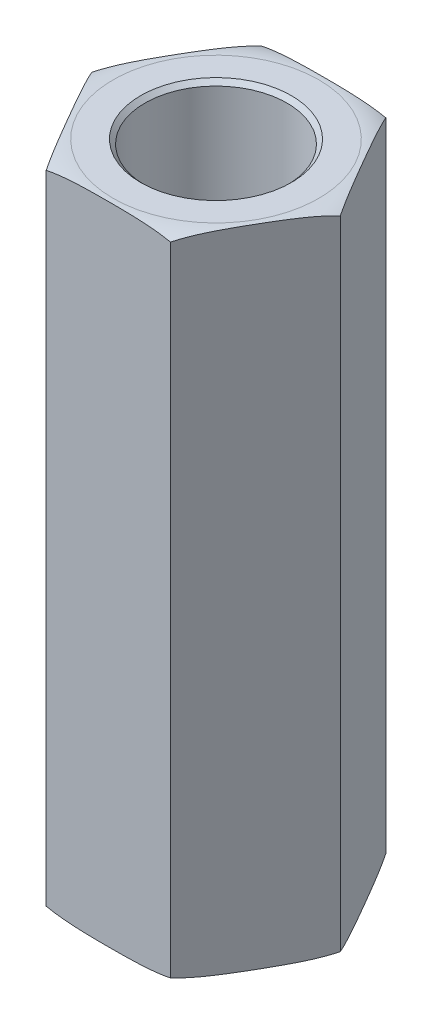
ISO-10303-21;
HEADER;
FILE_DESCRIPTION(('STEP AP214'),'2;1');
FILE_NAME('part.step','',(''),(''),'','','');
FILE_SCHEMA(('AUTOMOTIVE_DESIGN { 1 0 10303 214 1 1 1 1 }'));
ENDSEC;
DATA;
#1=APPLICATION_CONTEXT('core data for automotive mechanical design processes');
#2=APPLICATION_PROTOCOL_DEFINITION('international standard','automotive_design',2000,#1);
#3=PRODUCT_CONTEXT('',#1,'mechanical');
#4=PRODUCT('Part','Part','',(#3));
#5=PRODUCT_RELATED_PRODUCT_CATEGORY('part','',(#4));
#6=PRODUCT_DEFINITION_FORMATION('','',#4);
#7=PRODUCT_DEFINITION_CONTEXT('part definition',#1,'design');
#8=PRODUCT_DEFINITION('design','',#6,#7);
#9=PRODUCT_DEFINITION_SHAPE('','',#8);
#10=(LENGTH_UNIT() NAMED_UNIT(*) SI_UNIT(.MILLI.,.METRE.));
#11=(NAMED_UNIT(*) PLANE_ANGLE_UNIT() SI_UNIT($,.RADIAN.));
#12=(NAMED_UNIT(*) SI_UNIT($,.STERADIAN.) SOLID_ANGLE_UNIT());
#13=UNCERTAINTY_MEASURE_WITH_UNIT(LENGTH_MEASURE(1.E-05),#10,'distance_accuracy_value','');
#14=(GEOMETRIC_REPRESENTATION_CONTEXT(3) GLOBAL_UNCERTAINTY_ASSIGNED_CONTEXT((#13)) GLOBAL_UNIT_ASSIGNED_CONTEXT((#10,
#11,#12)) REPRESENTATION_CONTEXT('',''));
#15=CARTESIAN_POINT('',(0.,0.,0.));
#16=DIRECTION('',(0.,0.,1.));
#17=DIRECTION('',(1.,0.,0.));
#18=AXIS2_PLACEMENT_3D('',#15,#16,#17);
#19=CARTESIAN_POINT('',(3.66617420935412,9.525,0.));
#20=DIRECTION('',(-0.866025403784439,0.,0.5));
#21=DIRECTION('',(0.5,0.,0.866025403784439));
#22=AXIS2_PLACEMENT_3D('',#19,#20,#21);
#23=PLANE('',#22);
#24=DIRECTION('',(0.,1.,0.));
#25=VECTOR('',#24,1.);
#26=CARTESIAN_POINT('',(1.83308710467705,9.525,-3.175));
#27=LINE('',#26,#25);
#28=CARTESIAN_POINT('',(1.83308710467705,-9.398,-3.175));
#29=VERTEX_POINT('',#28);
#30=CARTESIAN_POINT('',(1.83308710467706,9.398,-3.175));
#31=VERTEX_POINT('',#30);
#32=EDGE_CURVE('E142',#29,#31,#27,.T.);
#33=ORIENTED_EDGE('',*,*,#32,.T.);
#34=CARTESIAN_POINT('',(3.66617420935412,9.398,0.));
#35=CARTESIAN_POINT('',(3.62797961467395,9.41390141489969,-0.0661549785605542));
#36=CARTESIAN_POINT('',(3.58956810864157,9.4274886076105,-0.132685658603869));
#37=CARTESIAN_POINT('',(3.51249051795711,9.45081619794021,-0.266187961794349));
#38=CARTESIAN_POINT('',(3.47382473049847,9.46056047713974,-0.333159070187379));
#39=CARTESIAN_POINT('',(3.39641631867874,9.4769966530451,-0.467234372392366));
#40=CARTESIAN_POINT('',(3.35767399633313,9.48369453286691,-0.534338043098168));
#41=CARTESIAN_POINT('',(3.28009834620114,9.4947767572932,-0.668703010556962));
#42=CARTESIAN_POINT('',(3.24126499587772,9.49916045047396,-0.735964346345247));
#43=CARTESIAN_POINT('',(3.16354065964316,9.50624030042628,-0.870586845688074));
#44=CARTESIAN_POINT('',(3.12464965374477,9.50893552375912,-0.937948043861543));
#45=CARTESIAN_POINT('',(3.04685144594594,9.51315319837134,-1.07269849250692));
#46=CARTESIAN_POINT('',(3.00794424351971,9.51467560802717,-1.14008774388952));
#47=CARTESIAN_POINT('',(2.93051517598875,9.51692270588903,-1.27419882283583));
#48=CARTESIAN_POINT('',(2.89199336248936,9.51765524681809,-1.34092056101645));
#49=CARTESIAN_POINT('',(2.81494778346146,9.51857673025742,-1.47436741839135));
#50=CARTESIAN_POINT('',(2.77642401791441,9.51876566589491,-1.5410925376177));
#51=CARTESIAN_POINT('',(2.69935964431015,9.51866599668056,-1.67457194815376));
#52=CARTESIAN_POINT('',(2.66081903631824,9.51837718117656,-1.74132623935034));
#53=CARTESIAN_POINT('',(2.58373908085332,9.517221986219,-1.87483263846072));
#54=CARTESIAN_POINT('',(2.54519973341248,9.51635559703857,-1.94158474631881));
#55=CARTESIAN_POINT('',(2.46812969629774,9.51378619406564,-2.07507396634277));
#56=CARTESIAN_POINT('',(2.42959900625968,9.51208322716166,-2.14181107913937));
#57=CARTESIAN_POINT('',(2.35255651340912,9.50743872297261,-2.27525259109831));
#58=CARTESIAN_POINT('',(2.31404470975446,9.50449724713581,-2.34195699171929));
#59=CARTESIAN_POINT('',(2.25084206239948,9.49821741247489,-2.45142718811098));
#60=CARTESIAN_POINT('',(2.22613849337013,9.49539801104633,-2.4942150247981));
#61=CARTESIAN_POINT('',(2.1767694527223,9.48886967943037,-2.57972471152106));
#62=CARTESIAN_POINT('',(2.15210397034186,9.48516108091391,-2.62244658019719));
#63=CARTESIAN_POINT('',(2.10282753811698,9.4766802711497,-2.70779586442641));
#64=CARTESIAN_POINT('',(2.07821657107531,9.47190846570085,-2.75042330976598));
#65=CARTESIAN_POINT('',(2.02900094683551,9.4610987712516,-2.83566727147553));
#66=CARTESIAN_POINT('',(2.00439646085464,9.45505773130843,-2.87828349128851));
#67=CARTESIAN_POINT('',(1.95527325900934,9.44151383541612,-2.96336737271503));
#68=CARTESIAN_POINT('',(1.93075459617615,9.43401019780297,-3.00583494247578));
#69=CARTESIAN_POINT('',(1.88182157373171,9.41732035070844,-3.09058942351744));
#70=CARTESIAN_POINT('',(1.85740744053269,9.40813149780328,-3.1328759426409));
#71=CARTESIAN_POINT('',(1.83308710467706,9.398,-3.175));
#72=B_SPLINE_CURVE_WITH_KNOTS('',3,(#34,#35,#36,#37,#38,#39,#40,#41,#42,#43,#44,#45,#46,#47,#48,
#49,#50,#51,#52,#53,#54,#55,#56,#57,#58,#59,#60,#61,#62,#63,#64,#65,#66,#67,#68,#69,#70,#71),
.UNSPECIFIED.,.F.,.F.,(4,2,2,2,2,2,2,2,2,2,2,2,2,2,2,2,2,2,4),(0.,0.233977307817935,
0.467717675040681,0.70099697355748,0.934341903229723,1.16781571967236,1.40129782179821,
1.63243665809665,1.86357841666612,2.09482211846288,2.32606971471488,2.5573043514739,
2.78852751694405,2.93698369265081,3.08538458004469,3.23372892334581,3.3824459854661,
3.53124274626083,3.68027493713586),.UNSPECIFIED.);
#73=CARTESIAN_POINT('',(3.66617420935412,9.398,0.));
#74=VERTEX_POINT('',#73);
#75=EDGE_CURVE('E96',#74,#31,#72,.T.);
#76=ORIENTED_EDGE('',*,*,#75,.F.);
#77=DIRECTION('',(0.,1.,0.));
#78=VECTOR('',#77,1.);
#79=CARTESIAN_POINT('',(3.66617420935412,9.525,0.));
#80=LINE('',#79,#78);
#81=CARTESIAN_POINT('',(3.66617420935412,-9.398,0.));
#82=VERTEX_POINT('',#81);
#83=EDGE_CURVE('E144',#74,#82,#80,.F.);
#84=ORIENTED_EDGE('',*,*,#83,.T.);
#85=CARTESIAN_POINT('',(1.83308710467705,-9.398,-3.17500000000001));
#86=CARTESIAN_POINT('',(1.87128169935722,-9.41390141489968,-3.10884502143945));
#87=CARTESIAN_POINT('',(1.9096932053896,-9.4274886076105,-3.04231434139614));
#88=CARTESIAN_POINT('',(1.98677079607406,-9.4508161979402,-2.90881203820566));
#89=CARTESIAN_POINT('',(2.0254365835327,-9.46056047713973,-2.84184092981263));
#90=CARTESIAN_POINT('',(2.10284499535243,-9.47699665304509,-2.70776562760765));
#91=CARTESIAN_POINT('',(2.14158731769803,-9.48369453286691,-2.64066195690184));
#92=CARTESIAN_POINT('',(2.21916296783002,-9.49477675729319,-2.50629698944305));
#93=CARTESIAN_POINT('',(2.25799631815344,-9.49916045047396,-2.43903565365477));
#94=CARTESIAN_POINT('',(2.335720654388,-9.50624030042628,-2.30441315431194));
#95=CARTESIAN_POINT('',(2.37461166028639,-9.50893552375912,-2.23705195613848));
#96=CARTESIAN_POINT('',(2.45240986808522,-9.51315319837134,-2.10230150749311));
#97=CARTESIAN_POINT('',(2.49131707051145,-9.51467560802717,-2.0349122561105));
#98=CARTESIAN_POINT('',(2.56874613804241,-9.51692270588903,-1.9008011771642));
#99=CARTESIAN_POINT('',(2.6072679515418,-9.51765524681809,-1.83407943898357));
#100=CARTESIAN_POINT('',(2.6843135305697,-9.51857673025742,-1.70063258160867));
#101=CARTESIAN_POINT('',(2.72283729611674,-9.51876566589491,-1.63390746238233));
#102=CARTESIAN_POINT('',(2.79990166972101,-9.51866599668056,-1.50042805184627));
#103=CARTESIAN_POINT('',(2.83844227771292,-9.51837718117656,-1.43367376064969));
#104=CARTESIAN_POINT('',(2.91552223317783,-9.517221986219,-1.30016736153931));
#105=CARTESIAN_POINT('',(2.95406158061867,-9.51635559703857,-1.23341525368122));
#106=CARTESIAN_POINT('',(3.03113161773342,-9.51378619406564,-1.09992603365727));
#107=CARTESIAN_POINT('',(3.06966230777147,-9.51208322716166,-1.03318892086067));
#108=CARTESIAN_POINT('',(3.14670480062203,-9.50743872297261,-0.899747408901733));
#109=CARTESIAN_POINT('',(3.18521660427669,-9.50449724713582,-0.83304300828075));
#110=CARTESIAN_POINT('',(3.24841925163167,-9.49821741247489,-0.723572811889063));
#111=CARTESIAN_POINT('',(3.27312282066102,-9.49539801104633,-0.680784975201942));
#112=CARTESIAN_POINT('',(3.32249186130885,-9.48886967943037,-0.595275288478971));
#113=CARTESIAN_POINT('',(3.3471573436893,-9.48516108091391,-0.552553419802841));
#114=CARTESIAN_POINT('',(3.39643377591418,-9.4766802711497,-0.46720413557362));
#115=CARTESIAN_POINT('',(3.42104474295585,-9.47190846570085,-0.424576690234039));
#116=CARTESIAN_POINT('',(3.47026036719565,-9.4610987712516,-0.339332728524487));
#117=CARTESIAN_POINT('',(3.49486485317652,-9.45505773130843,-0.296716508711511));
#118=CARTESIAN_POINT('',(3.54398805502183,-9.44151383541613,-0.211632627284978));
#119=CARTESIAN_POINT('',(3.56850671785502,-9.43401019780297,-0.169165057524231));
#120=CARTESIAN_POINT('',(3.61743974029946,-9.41732035070845,-0.08441057648256));
#121=CARTESIAN_POINT('',(3.64185387349848,-9.40813149780329,-0.0421240573591054));
#122=CARTESIAN_POINT('',(3.66617420935412,-9.398,0.));
#123=B_SPLINE_CURVE_WITH_KNOTS('',3,(#85,#86,#87,#88,#89,#90,#91,#92,#93,#94,#95,#96,#97,#98,
#99,#100,#101,#102,#103,#104,#105,#106,#107,#108,#109,#110,#111,#112,#113,#114,#115,#116,#117,
#118,#119,#120,#121,#122),.UNSPECIFIED.,.F.,.F.,(4,2,2,2,2,2,2,2,2,2,2,2,2,2,2,2,2,2,4),(0.,
0.233977307817932,0.467717675040674,0.700996973557469,0.934341903229708,1.16781571967234,
1.40129782179818,1.63243665809662,1.86357841666608,2.09482211846285,2.32606971471484,
2.55730435147386,2.78852751694401,2.93698369265077,3.08538458004466,3.23372892334579,
3.38244598546609,3.53124274626083,3.68027493713586),.UNSPECIFIED.);
#124=EDGE_CURVE('E220',#29,#82,#123,.T.);
#125=ORIENTED_EDGE('',*,*,#124,.F.);
#126=EDGE_LOOP('',(#33,#76,#84,#125));
#127=FACE_BOUND('',#126,.T.);
#128=ADVANCED_FACE('F16',(#127),#23,.F.);
#129=CARTESIAN_POINT('',(1.83308710467706,9.525,3.17499999999999));
#130=DIRECTION('',(-0.866025403784439,0.,-0.5));
#131=DIRECTION('',(-0.5,0.,0.866025403784439));
#132=AXIS2_PLACEMENT_3D('',#129,#130,#131);
#133=PLANE('',#132);
#134=ORIENTED_EDGE('',*,*,#83,.F.);
#135=CARTESIAN_POINT('',(1.83308710467706,9.398,3.17499999999999));
#136=CARTESIAN_POINT('',(1.87128169935724,9.41390141489969,3.10884502143943));
#137=CARTESIAN_POINT('',(1.90969320538961,9.4274886076105,3.04231434139612));
#138=CARTESIAN_POINT('',(1.98677079607407,9.45081619794021,2.90881203820564));
#139=CARTESIAN_POINT('',(2.02543658353271,9.46056047713974,2.84184092981261));
#140=CARTESIAN_POINT('',(2.10284499535245,9.4769966530451,2.70776562760762));
#141=CARTESIAN_POINT('',(2.14158731769805,9.48369453286691,2.64066195690182));
#142=CARTESIAN_POINT('',(2.21916296783004,9.4947767572932,2.50629698944302));
#143=CARTESIAN_POINT('',(2.25799631815346,9.49916045047396,2.43903565365474));
#144=CARTESIAN_POINT('',(2.33572065438802,9.50624030042628,2.30441315431191));
#145=CARTESIAN_POINT('',(2.37461166028641,9.50893552375912,2.23705195613844));
#146=CARTESIAN_POINT('',(2.45240986808524,9.51315319837134,2.10230150749307));
#147=CARTESIAN_POINT('',(2.49131707051148,9.51467560802717,2.03491225611046));
#148=CARTESIAN_POINT('',(2.56874613804244,9.51692270588903,1.90080117716416));
#149=CARTESIAN_POINT('',(2.60726795154182,9.51765524681809,1.83407943898353));
#150=CARTESIAN_POINT('',(2.68431353056973,9.51857673025742,1.70063258160863));
#151=CARTESIAN_POINT('',(2.72283729611677,9.51876566589491,1.63390746238228));
#152=CARTESIAN_POINT('',(2.79990166972104,9.51866599668056,1.50042805184622));
#153=CARTESIAN_POINT('',(2.83844227771295,9.51837718117656,1.43367376064964));
#154=CARTESIAN_POINT('',(2.91552223317786,9.517221986219,1.30016736153926));
#155=CARTESIAN_POINT('',(2.95406158061871,9.51635559703857,1.23341525368117));
#156=CARTESIAN_POINT('',(3.03113161773345,9.51378619406564,1.09992603365721));
#157=CARTESIAN_POINT('',(3.06966230777151,9.51208322716166,1.03318892086061));
#158=CARTESIAN_POINT('',(3.14670480062207,9.50743872297261,0.899747408901672));
#159=CARTESIAN_POINT('',(3.18521660427673,9.50449724713581,0.833043008280688));
#160=CARTESIAN_POINT('',(3.24841925163171,9.49821741247489,0.723572811889004));
#161=CARTESIAN_POINT('',(3.27312282066106,9.49539801104633,0.680784975201887));
#162=CARTESIAN_POINT('',(3.32249186130888,9.48886967943037,0.595275288478923));
#163=CARTESIAN_POINT('',(3.34715734368933,9.48516108091391,0.552553419802797));
#164=CARTESIAN_POINT('',(3.3964337759142,9.4766802711497,0.467204135573584));
#165=CARTESIAN_POINT('',(3.42104474295588,9.47190846570085,0.424576690234007));
#166=CARTESIAN_POINT('',(3.47026036719567,9.4610987712516,0.339332728524462));
#167=CARTESIAN_POINT('',(3.49486485317654,9.45505773130843,0.296716508711489));
#168=CARTESIAN_POINT('',(3.54398805502184,9.44151383541612,0.211632627284964));
#169=CARTESIAN_POINT('',(3.56850671785503,9.43401019780297,0.169165057524221));
#170=CARTESIAN_POINT('',(3.61743974029946,9.41732035070844,0.0844105764825579));
#171=CARTESIAN_POINT('',(3.64185387349848,9.40813149780328,0.042124057359107));
#172=CARTESIAN_POINT('',(3.66617420935412,9.398,0.));
#173=B_SPLINE_CURVE_WITH_KNOTS('',3,(#135,#136,#137,#138,#139,#140,#141,#142,#143,#144,#145,
#146,#147,#148,#149,#150,#151,#152,#153,#154,#155,#156,#157,#158,#159,#160,#161,#162,#163,#164,
#165,#166,#167,#168,#169,#170,#171,#172),.UNSPECIFIED.,.F.,.F.,(4,2,2,2,2,2,2,2,2,2,2,2,2,2,2,2,
2,2,4),(0.,0.233977307817936,0.467717675040682,0.700996973557482,0.934341903229727,
1.16781571967237,1.40129782179821,1.63243665809666,1.86357841666612,2.09482211846289,
2.32606971471489,2.55730435147391,2.78852751694406,2.93698369265081,3.08538458004469,
3.23372892334581,3.3824459854661,3.53124274626082,3.68027493713584),.UNSPECIFIED.);
#174=CARTESIAN_POINT('',(1.83308710467707,9.398,3.17499999999999));
#175=VERTEX_POINT('',#174);
#176=EDGE_CURVE('E213',#175,#74,#173,.T.);
#177=ORIENTED_EDGE('',*,*,#176,.F.);
#178=DIRECTION('',(0.,1.,0.));
#179=VECTOR('',#178,1.);
#180=CARTESIAN_POINT('',(1.83308710467707,9.525,3.17499999999999));
#181=LINE('',#180,#179);
#182=CARTESIAN_POINT('',(1.83308710467706,-9.398,3.17499999999999));
#183=VERTEX_POINT('',#182);
#184=EDGE_CURVE('E139',#175,#183,#181,.F.);
#185=ORIENTED_EDGE('',*,*,#184,.T.);
#186=CARTESIAN_POINT('',(3.66617420935412,-9.398,0.));
#187=CARTESIAN_POINT('',(3.62797961467395,-9.41390141489969,0.0661549785605599));
#188=CARTESIAN_POINT('',(3.58956810864157,-9.4274886076105,0.132685658603875));
#189=CARTESIAN_POINT('',(3.51249051795711,-9.45081619794021,0.266187961794355));
#190=CARTESIAN_POINT('',(3.47382473049847,-9.46056047713974,0.333159070187385));
#191=CARTESIAN_POINT('',(3.39641631867874,-9.4769966530451,0.467234372392373));
#192=CARTESIAN_POINT('',(3.35767399633313,-9.48369453286691,0.534338043098174));
#193=CARTESIAN_POINT('',(3.28009834620114,-9.4947767572932,0.668703010556968));
#194=CARTESIAN_POINT('',(3.24126499587772,-9.49916045047396,0.735964346345254));
#195=CARTESIAN_POINT('',(3.16354065964316,-9.50624030042628,0.87058684568808));
#196=CARTESIAN_POINT('',(3.12464965374477,-9.50893552375912,0.93794804386155));
#197=CARTESIAN_POINT('',(3.04685144594594,-9.51315319837134,1.07269849250692));
#198=CARTESIAN_POINT('',(3.00794424351971,-9.51467560802717,1.14008774388953));
#199=CARTESIAN_POINT('',(2.93051517598875,-9.51692270588903,1.27419882283583));
#200=CARTESIAN_POINT('',(2.89199336248936,-9.51765524681809,1.34092056101646));
#201=CARTESIAN_POINT('',(2.81494778346145,-9.51857673025742,1.47436741839136));
#202=CARTESIAN_POINT('',(2.77642401791441,-9.51876566589491,1.54109253761771));
#203=CARTESIAN_POINT('',(2.69935964431015,-9.51866599668056,1.67457194815377));
#204=CARTESIAN_POINT('',(2.66081903631824,-9.51837718117656,1.74132623935035));
#205=CARTESIAN_POINT('',(2.58373908085332,-9.517221986219,1.87483263846073));
#206=CARTESIAN_POINT('',(2.54519973341248,-9.51635559703857,1.94158474631882));
#207=CARTESIAN_POINT('',(2.46812969629773,-9.51378619406564,2.07507396634278));
#208=CARTESIAN_POINT('',(2.42959900625968,-9.51208322716166,2.14181107913938));
#209=CARTESIAN_POINT('',(2.35255651340911,-9.50743872297261,2.27525259109832));
#210=CARTESIAN_POINT('',(2.31404470975446,-9.50449724713581,2.3419569917193));
#211=CARTESIAN_POINT('',(2.25084206239948,-9.49821741247489,2.45142718811099));
#212=CARTESIAN_POINT('',(2.22613849337013,-9.49539801104633,2.4942150247981));
#213=CARTESIAN_POINT('',(2.1767694527223,-9.48886967943037,2.57972471152107));
#214=CARTESIAN_POINT('',(2.15210397034186,-9.48516108091391,2.62244658019719));
#215=CARTESIAN_POINT('',(2.10282753811698,-9.4766802711497,2.70779586442641));
#216=CARTESIAN_POINT('',(2.07821657107531,-9.47190846570085,2.75042330976598));
#217=CARTESIAN_POINT('',(2.02900094683551,-9.4610987712516,2.83566727147553));
#218=CARTESIAN_POINT('',(2.00439646085465,-9.45505773130843,2.8782834912885));
#219=CARTESIAN_POINT('',(1.95527325900934,-9.44151383541612,2.96336737271503));
#220=CARTESIAN_POINT('',(1.93075459617615,-9.43401019780296,3.00583494247577));
#221=CARTESIAN_POINT('',(1.88182157373172,-9.41732035070844,3.09058942351744));
#222=CARTESIAN_POINT('',(1.8574074405327,-9.40813149780329,3.13287594264089));
#223=CARTESIAN_POINT('',(1.83308710467706,-9.398,3.17499999999999));
#224=B_SPLINE_CURVE_WITH_KNOTS('',3,(#186,#187,#188,#189,#190,#191,#192,#193,#194,#195,#196,
#197,#198,#199,#200,#201,#202,#203,#204,#205,#206,#207,#208,#209,#210,#211,#212,#213,#214,#215,
#216,#217,#218,#219,#220,#221,#222,#223),.UNSPECIFIED.,.F.,.F.,(4,2,2,2,2,2,2,2,2,2,2,2,2,2,2,2,
2,2,4),(0.,0.233977307817936,0.467717675040682,0.700996973557481,0.934341903229725,
1.16781571967236,1.40129782179821,1.63243665809665,1.86357841666612,2.09482211846289,
2.32606971471488,2.55730435147391,2.78852751694405,2.93698369265081,3.08538458004468,
3.2337289233458,3.38244598546609,3.53124274626082,3.68027493713584),.UNSPECIFIED.);
#225=EDGE_CURVE('E239',#82,#183,#224,.T.);
#226=ORIENTED_EDGE('',*,*,#225,.F.);
#227=EDGE_LOOP('',(#134,#177,#185,#226));
#228=FACE_BOUND('',#227,.T.);
#229=ADVANCED_FACE('F217',(#228),#133,.F.);
#230=CARTESIAN_POINT('',(1.83308710467706,9.525,-3.175));
#231=DIRECTION('',(0.,0.,1.));
#232=DIRECTION('',(1.,0.,0.));
#233=AXIS2_PLACEMENT_3D('',#230,#231,#232);
#234=PLANE('',#233);
#235=DIRECTION('',(0.,1.,0.));
#236=VECTOR('',#235,1.);
#237=CARTESIAN_POINT('',(-1.83308710467707,9.525,-3.175));
#238=LINE('',#237,#236);
#239=CARTESIAN_POINT('',(-1.83308710467707,-9.39799999999999,-3.175));
#240=VERTEX_POINT('',#239);
#241=CARTESIAN_POINT('',(-1.83308710467706,9.398,-3.17500000000001));
#242=VERTEX_POINT('',#241);
#243=EDGE_CURVE('E103',#240,#242,#238,.T.);
#244=ORIENTED_EDGE('',*,*,#243,.T.);
#245=CARTESIAN_POINT('',(1.83308710467706,9.398,-3.175));
#246=CARTESIAN_POINT('',(1.73237579828683,9.41894001415179,-3.175));
#247=CARTESIAN_POINT('',(1.63096506893486,9.43588534953273,-3.175));
#248=CARTESIAN_POINT('',(1.42767146651469,9.46349716439842,-3.175));
#249=CARTESIAN_POINT('',(1.32579191427254,9.47418756587531,-3.175));
#250=CARTESIAN_POINT('',(1.12177634709137,9.49112804080793,-3.175));
#251=CARTESIAN_POINT('',(1.0196405664338,9.49738127071887,-3.175));
#252=CARTESIAN_POINT('',(0.815663681397375,9.50690280641833,-3.175));
#253=CARTESIAN_POINT('',(0.713823115514573,9.5101834044999,-3.175));
#254=CARTESIAN_POINT('',(0.510018485441651,9.51494548487028,-3.175));
#255=CARTESIAN_POINT('',(0.408054390577976,9.51642541008817,-3.175));
#256=CARTESIAN_POINT('',(0.20406020033787,9.51831468183793,-3.175));
#257=CARTESIAN_POINT('',(0.102030100168935,9.51872342414921,-3.175));
#258=CARTESIAN_POINT('',(-0.102030100168934,9.51872342414921,-3.175));
#259=CARTESIAN_POINT('',(-0.204060200337869,9.51831468183793,-3.175));
#260=CARTESIAN_POINT('',(-0.408054390577975,9.51642541008817,-3.175));
#261=CARTESIAN_POINT('',(-0.510018485441649,9.51494548487028,-3.175));
#262=CARTESIAN_POINT('',(-0.713823115514571,9.5101834044999,-3.175));
#263=CARTESIAN_POINT('',(-0.815663681397373,9.50690280641833,-3.175));
#264=CARTESIAN_POINT('',(-1.01964056643379,9.49738127071887,-3.175));
#265=CARTESIAN_POINT('',(-1.12177634709137,9.49112804080793,-3.175));
#266=CARTESIAN_POINT('',(-1.32579191427253,9.47418756587531,-3.175));
#267=CARTESIAN_POINT('',(-1.42767146651469,9.46349716439842,-3.175));
#268=CARTESIAN_POINT('',(-1.63096506893485,9.43588534953273,-3.175));
#269=CARTESIAN_POINT('',(-1.73237579828683,9.41894001415179,-3.175));
#270=CARTESIAN_POINT('',(-1.83308710467705,9.398,-3.17500000000001));
#271=B_SPLINE_CURVE_WITH_KNOTS('',3,(#245,#246,#247,#248,#249,#250,#251,#252,#253,#254,#255,
#256,#257,#258,#259,#260,#261,#262,#263,#264,#265,#266,#267,#268,#269,#270),.UNSPECIFIED.,.F.,
.F.,(4,2,2,2,2,2,2,2,2,2,2,2,4),(0.,0.308333242342807,0.615479423308234,0.922406891130008,
1.2280592962085,1.53397581645216,1.84006485747889,2.14615389850561,2.45207041874927,
2.75772282382776,3.06465029164954,3.37179647261496,3.68012971495777),.UNSPECIFIED.);
#272=EDGE_CURVE('E88',#31,#242,#271,.T.);
#273=ORIENTED_EDGE('',*,*,#272,.F.);
#274=ORIENTED_EDGE('',*,*,#32,.F.);
#275=CARTESIAN_POINT('',(-1.83308710467707,-9.39799999999999,-3.175));
#276=CARTESIAN_POINT('',(-1.73237579828684,-9.41894001415179,-3.175));
#277=CARTESIAN_POINT('',(-1.63096506893487,-9.43588534953273,-3.175));
#278=CARTESIAN_POINT('',(-1.4276714665147,-9.46349716439842,-3.175));
#279=CARTESIAN_POINT('',(-1.32579191427255,-9.47418756587531,-3.175));
#280=CARTESIAN_POINT('',(-1.12177634709138,-9.49112804080793,-3.175));
#281=CARTESIAN_POINT('',(-1.0196405664338,-9.49738127071887,-3.175));
#282=CARTESIAN_POINT('',(-0.81566368139738,-9.50690280641833,-3.175));
#283=CARTESIAN_POINT('',(-0.713823115514577,-9.5101834044999,-3.175));
#284=CARTESIAN_POINT('',(-0.510018485441654,-9.51494548487028,-3.175));
#285=CARTESIAN_POINT('',(-0.408054390577979,-9.51642541008817,-3.175));
#286=CARTESIAN_POINT('',(-0.204060200337872,-9.51831468183793,-3.175));
#287=CARTESIAN_POINT('',(-0.102030100168936,-9.51872342414921,-3.175));
#288=CARTESIAN_POINT('',(0.102030100168934,-9.51872342414921,-3.175));
#289=CARTESIAN_POINT('',(0.204060200337869,-9.51831468183793,-3.175));
#290=CARTESIAN_POINT('',(0.408054390577974,-9.51642541008817,-3.175));
#291=CARTESIAN_POINT('',(0.510018485441648,-9.51494548487028,-3.175));
#292=CARTESIAN_POINT('',(0.713823115514568,-9.5101834044999,-3.175));
#293=CARTESIAN_POINT('',(0.81566368139737,-9.50690280641833,-3.175));
#294=CARTESIAN_POINT('',(1.01964056643379,-9.49738127071887,-3.175));
#295=CARTESIAN_POINT('',(1.12177634709137,-9.49112804080794,-3.175));
#296=CARTESIAN_POINT('',(1.32579191427253,-9.47418756587531,-3.175));
#297=CARTESIAN_POINT('',(1.42767146651468,-9.46349716439843,-3.175));
#298=CARTESIAN_POINT('',(1.63096506893485,-9.43588534953273,-3.175));
#299=CARTESIAN_POINT('',(1.73237579828682,-9.41894001415179,-3.175));
#300=CARTESIAN_POINT('',(1.83308710467705,-9.398,-3.175));
#301=B_SPLINE_CURVE_WITH_KNOTS('',3,(#275,#276,#277,#278,#279,#280,#281,#282,#283,#284,#285,
#286,#287,#288,#289,#290,#291,#292,#293,#294,#295,#296,#297,#298,#299,#300),.UNSPECIFIED.,.F.,
.F.,(4,2,2,2,2,2,2,2,2,2,2,2,4),(0.,0.308333242342809,0.615479423308238,0.922406891130013,
1.22805929620851,1.53397581645217,1.8400648574789,2.14615389850562,2.45207041874928,
2.75772282382777,3.06465029164954,3.37179647261497,3.68012971495777),.UNSPECIFIED.);
#302=EDGE_CURVE('E105',#240,#29,#301,.T.);
#303=ORIENTED_EDGE('',*,*,#302,.F.);
#304=EDGE_LOOP('',(#244,#273,#274,#303));
#305=FACE_BOUND('',#304,.T.);
#306=ADVANCED_FACE('F104',(#305),#234,.F.);
#307=CARTESIAN_POINT('',(-1.83308710467707,9.525,3.175));
#308=DIRECTION('',(0.,0.,-1.));
#309=DIRECTION('',(-1.,0.,0.));
#310=AXIS2_PLACEMENT_3D('',#307,#308,#309);
#311=PLANE('',#310);
#312=ORIENTED_EDGE('',*,*,#184,.F.);
#313=CARTESIAN_POINT('',(-1.83308710467706,9.398,3.175));
#314=CARTESIAN_POINT('',(-1.73237579828684,9.41894001415179,3.175));
#315=CARTESIAN_POINT('',(-1.63096506893486,9.43588534953273,3.175));
#316=CARTESIAN_POINT('',(-1.42767146651469,9.46349716439843,3.175));
#317=CARTESIAN_POINT('',(-1.32579191427254,9.47418756587531,3.175));
#318=CARTESIAN_POINT('',(-1.12177634709138,9.49112804080793,3.175));
#319=CARTESIAN_POINT('',(-1.0196405664338,9.49738127071888,3.175));
#320=CARTESIAN_POINT('',(-0.815663681397378,9.50690280641833,3.175));
#321=CARTESIAN_POINT('',(-0.713823115514575,9.5101834044999,3.175));
#322=CARTESIAN_POINT('',(-0.510018485441652,9.51494548487029,3.175));
#323=CARTESIAN_POINT('',(-0.408054390577978,9.51642541008817,3.175));
#324=CARTESIAN_POINT('',(-0.204060200337871,9.51831468183793,3.175));
#325=CARTESIAN_POINT('',(-0.102030100168935,9.51872342414921,3.17499999999999));
#326=CARTESIAN_POINT('',(0.102030100168936,9.51872342414921,3.17499999999999));
#327=CARTESIAN_POINT('',(0.204060200337871,9.51831468183793,3.17499999999999));
#328=CARTESIAN_POINT('',(0.408054390577978,9.51642541008817,3.17499999999999));
#329=CARTESIAN_POINT('',(0.510018485441653,9.51494548487029,3.17499999999999));
#330=CARTESIAN_POINT('',(0.713823115514576,9.5101834044999,3.17499999999999));
#331=CARTESIAN_POINT('',(0.815663681397379,9.50690280641833,3.17499999999999));
#332=CARTESIAN_POINT('',(1.0196405664338,9.49738127071888,3.17499999999999));
#333=CARTESIAN_POINT('',(1.12177634709138,9.49112804080794,3.17499999999999));
#334=CARTESIAN_POINT('',(1.32579191427254,9.47418756587531,3.17499999999999));
#335=CARTESIAN_POINT('',(1.4276714665147,9.46349716439843,3.17499999999999));
#336=CARTESIAN_POINT('',(1.63096506893486,9.43588534953273,3.17499999999999));
#337=CARTESIAN_POINT('',(1.73237579828684,9.41894001415179,3.17499999999999));
#338=CARTESIAN_POINT('',(1.83308710467707,9.398,3.17499999999999));
#339=B_SPLINE_CURVE_WITH_KNOTS('',3,(#313,#314,#315,#316,#317,#318,#319,#320,#321,#322,#323,
#324,#325,#326,#327,#328,#329,#330,#331,#332,#333,#334,#335,#336,#337,#338),.UNSPECIFIED.,.F.,
.F.,(4,2,2,2,2,2,2,2,2,2,2,2,4),(0.,0.308333242342809,0.615479423308237,0.922406891130012,
1.2280592962085,1.53397581645216,1.84006485747889,2.14615389850562,2.45207041874928,
2.75772282382778,3.06465029164955,3.37179647261498,3.68012971495779),.UNSPECIFIED.);
#340=CARTESIAN_POINT('',(-1.83308710467707,9.398,3.175));
#341=VERTEX_POINT('',#340);
#342=EDGE_CURVE('E99',#341,#175,#339,.T.);
#343=ORIENTED_EDGE('',*,*,#342,.F.);
#344=DIRECTION('',(0.,1.,0.));
#345=VECTOR('',#344,1.);
#346=CARTESIAN_POINT('',(-1.83308710467707,9.525,3.175));
#347=LINE('',#346,#345);
#348=CARTESIAN_POINT('',(-1.83308710467706,-9.398,3.175));
#349=VERTEX_POINT('',#348);
#350=EDGE_CURVE('E107',#341,#349,#347,.F.);
#351=ORIENTED_EDGE('',*,*,#350,.T.);
#352=CARTESIAN_POINT('',(1.83308710467706,-9.398,3.17499999999999));
#353=CARTESIAN_POINT('',(1.73237579828684,-9.41894001415179,3.17499999999999));
#354=CARTESIAN_POINT('',(1.63096506893486,-9.43588534953273,3.17499999999999));
#355=CARTESIAN_POINT('',(1.4276714665147,-9.46349716439843,3.17499999999999));
#356=CARTESIAN_POINT('',(1.32579191427254,-9.47418756587531,3.17499999999999));
#357=CARTESIAN_POINT('',(1.12177634709138,-9.49112804080793,3.17499999999999));
#358=CARTESIAN_POINT('',(1.0196405664338,-9.49738127071888,3.17499999999999));
#359=CARTESIAN_POINT('',(0.815663681397379,-9.50690280641833,3.17499999999999));
#360=CARTESIAN_POINT('',(0.713823115514576,-9.5101834044999,3.17499999999999));
#361=CARTESIAN_POINT('',(0.510018485441653,-9.51494548487029,3.17499999999999));
#362=CARTESIAN_POINT('',(0.408054390577978,-9.51642541008817,3.17499999999999));
#363=CARTESIAN_POINT('',(0.204060200337871,-9.51831468183793,3.17499999999999));
#364=CARTESIAN_POINT('',(0.102030100168935,-9.51872342414921,3.17499999999999));
#365=CARTESIAN_POINT('',(-0.102030100168935,-9.51872342414921,3.17499999999999));
#366=CARTESIAN_POINT('',(-0.204060200337871,-9.51831468183793,3.175));
#367=CARTESIAN_POINT('',(-0.408054390577977,-9.51642541008817,3.175));
#368=CARTESIAN_POINT('',(-0.510018485441652,-9.51494548487029,3.175));
#369=CARTESIAN_POINT('',(-0.713823115514575,-9.5101834044999,3.175));
#370=CARTESIAN_POINT('',(-0.815663681397378,-9.50690280641833,3.175));
#371=CARTESIAN_POINT('',(-1.0196405664338,-9.49738127071888,3.175));
#372=CARTESIAN_POINT('',(-1.12177634709138,-9.49112804080793,3.175));
#373=CARTESIAN_POINT('',(-1.32579191427254,-9.47418756587531,3.175));
#374=CARTESIAN_POINT('',(-1.42767146651469,-9.46349716439843,3.175));
#375=CARTESIAN_POINT('',(-1.63096506893486,-9.43588534953273,3.175));
#376=CARTESIAN_POINT('',(-1.73237579828684,-9.41894001415179,3.175));
#377=CARTESIAN_POINT('',(-1.83308710467706,-9.398,3.175));
#378=B_SPLINE_CURVE_WITH_KNOTS('',3,(#352,#353,#354,#355,#356,#357,#358,#359,#360,#361,#362,
#363,#364,#365,#366,#367,#368,#369,#370,#371,#372,#373,#374,#375,#376,#377),.UNSPECIFIED.,.F.,
.F.,(4,2,2,2,2,2,2,2,2,2,2,2,4),(0.,0.308333242342809,0.615479423308237,0.922406891130013,
1.22805929620851,1.53397581645217,1.84006485747889,2.14615389850562,2.45207041874928,
2.75772282382778,3.06465029164955,3.37179647261498,3.68012971495779),.UNSPECIFIED.);
#379=EDGE_CURVE('E207',#183,#349,#378,.T.);
#380=ORIENTED_EDGE('',*,*,#379,.F.);
#381=EDGE_LOOP('',(#312,#343,#351,#380));
#382=FACE_BOUND('',#381,.T.);
#383=ADVANCED_FACE('F351',(#382),#311,.F.);
#384=CARTESIAN_POINT('',(-3.66617420935413,9.525,0.));
#385=DIRECTION('',(0.866025403784439,0.,-0.499999999999999));
#386=DIRECTION('',(-0.499999999999999,0.,-0.866025403784439));
#387=AXIS2_PLACEMENT_3D('',#384,#385,#386);
#388=PLANE('',#387);
#389=ORIENTED_EDGE('',*,*,#350,.F.);
#390=CARTESIAN_POINT('',(-3.66617420935412,9.398,0.));
#391=CARTESIAN_POINT('',(-3.62797961467395,9.41390141489969,0.0661549785605627));
#392=CARTESIAN_POINT('',(-3.58956810864157,9.4274886076105,0.132685658603878));
#393=CARTESIAN_POINT('',(-3.51249051795711,9.4508161979402,0.266187961794359));
#394=CARTESIAN_POINT('',(-3.47382473049847,9.46056047713974,0.333159070187389));
#395=CARTESIAN_POINT('',(-3.39641631867874,9.47699665304509,0.467234372392377));
#396=CARTESIAN_POINT('',(-3.35767399633313,9.48369453286691,0.534338043098178));
#397=CARTESIAN_POINT('',(-3.28009834620114,9.49477675729319,0.668703010556972));
#398=CARTESIAN_POINT('',(-3.24126499587772,9.49916045047396,0.735964346345258));
#399=CARTESIAN_POINT('',(-3.16354065964316,9.50624030042628,0.870586845688085));
#400=CARTESIAN_POINT('',(-3.12464965374477,9.50893552375912,0.937948043861555));
#401=CARTESIAN_POINT('',(-3.04685144594594,9.51315319837134,1.07269849250693));
#402=CARTESIAN_POINT('',(-3.00794424351971,9.51467560802717,1.14008774388953));
#403=CARTESIAN_POINT('',(-2.93051517598875,9.51692270588903,1.27419882283584));
#404=CARTESIAN_POINT('',(-2.89199336248936,9.51765524681809,1.34092056101647));
#405=CARTESIAN_POINT('',(-2.81494778346146,9.51857673025742,1.47436741839137));
#406=CARTESIAN_POINT('',(-2.77642401791441,9.5187656658949,1.54109253761772));
#407=CARTESIAN_POINT('',(-2.69935964431015,9.51866599668056,1.67457194815378));
#408=CARTESIAN_POINT('',(-2.66081903631824,9.51837718117656,1.74132623935036));
#409=CARTESIAN_POINT('',(-2.58373908085332,9.517221986219,1.87483263846074));
#410=CARTESIAN_POINT('',(-2.54519973341248,9.51635559703857,1.94158474631883));
#411=CARTESIAN_POINT('',(-2.46812969629774,9.51378619406564,2.07507396634279));
#412=CARTESIAN_POINT('',(-2.42959900625968,9.51208322716166,2.14181107913938));
#413=CARTESIAN_POINT('',(-2.35255651340912,9.50743872297261,2.27525259109832));
#414=CARTESIAN_POINT('',(-2.31404470975446,9.50449724713581,2.34195699171931));
#415=CARTESIAN_POINT('',(-2.25084206239948,9.49821741247489,2.45142718811099));
#416=CARTESIAN_POINT('',(-2.22613849337013,9.49539801104632,2.49421502479811));
#417=CARTESIAN_POINT('',(-2.17676945272231,9.48886967943037,2.57972471152108));
#418=CARTESIAN_POINT('',(-2.15210397034186,9.48516108091391,2.6224465801972));
#419=CARTESIAN_POINT('',(-2.10282753811698,9.47668027114969,2.70779586442642));
#420=CARTESIAN_POINT('',(-2.07821657107531,9.47190846570085,2.75042330976599));
#421=CARTESIAN_POINT('',(-2.02900094683551,9.4610987712516,2.83566727147554));
#422=CARTESIAN_POINT('',(-2.00439646085465,9.45505773130842,2.87828349128851));
#423=CARTESIAN_POINT('',(-1.95527325900935,9.44151383541612,2.96336737271504));
#424=CARTESIAN_POINT('',(-1.93075459617615,9.43401019780296,3.00583494247578));
#425=CARTESIAN_POINT('',(-1.88182157373172,9.41732035070844,3.09058942351745));
#426=CARTESIAN_POINT('',(-1.8574074405327,9.40813149780328,3.1328759426409));
#427=CARTESIAN_POINT('',(-1.83308710467707,9.398,3.175));
#428=B_SPLINE_CURVE_WITH_KNOTS('',3,(#390,#391,#392,#393,#394,#395,#396,#397,#398,#399,#400,
#401,#402,#403,#404,#405,#406,#407,#408,#409,#410,#411,#412,#413,#414,#415,#416,#417,#418,#419,
#420,#421,#422,#423,#424,#425,#426,#427),.UNSPECIFIED.,.F.,.F.,(4,2,2,2,2,2,2,2,2,2,2,2,2,2,2,2,
2,2,4),(0.,0.233977307817936,0.467717675040682,0.700996973557482,0.934341903229725,
1.16781571967237,1.40129782179821,1.63243665809665,1.86357841666612,2.09482211846289,
2.32606971471489,2.55730435147391,2.78852751694406,2.93698369265081,3.08538458004469,
3.23372892334581,3.3824459854661,3.53124274626082,3.68027493713584),.UNSPECIFIED.);
#429=CARTESIAN_POINT('',(-3.66617420935413,9.398,0.));
#430=VERTEX_POINT('',#429);
#431=EDGE_CURVE('E100',#430,#341,#428,.T.);
#432=ORIENTED_EDGE('',*,*,#431,.F.);
#433=DIRECTION('',(0.,1.,0.));
#434=VECTOR('',#433,1.);
#435=CARTESIAN_POINT('',(-3.66617420935413,9.525,0.));
#436=LINE('',#435,#434);
#437=CARTESIAN_POINT('',(-3.66617420935412,-9.398,0.));
#438=VERTEX_POINT('',#437);
#439=EDGE_CURVE('E82',#430,#438,#436,.F.);
#440=ORIENTED_EDGE('',*,*,#439,.T.);
#441=CARTESIAN_POINT('',(-1.83308710467707,-9.398,3.175));
#442=CARTESIAN_POINT('',(-1.87128169935724,-9.41390141489968,3.10884502143945));
#443=CARTESIAN_POINT('',(-1.90969320538961,-9.4274886076105,3.04231434139613));
#444=CARTESIAN_POINT('',(-1.98677079607407,-9.4508161979402,2.90881203820565));
#445=CARTESIAN_POINT('',(-2.02543658353271,-9.46056047713973,2.84184092981263));
#446=CARTESIAN_POINT('',(-2.10284499535244,-9.47699665304509,2.70776562760764));
#447=CARTESIAN_POINT('',(-2.14158731769805,-9.48369453286691,2.64066195690184));
#448=CARTESIAN_POINT('',(-2.21916296783004,-9.49477675729319,2.50629698944305));
#449=CARTESIAN_POINT('',(-2.25799631815346,-9.49916045047396,2.43903565365476));
#450=CARTESIAN_POINT('',(-2.33572065438802,-9.50624030042628,2.30441315431194));
#451=CARTESIAN_POINT('',(-2.3746116602864,-9.50893552375912,2.23705195613847));
#452=CARTESIAN_POINT('',(-2.45240986808523,-9.51315319837134,2.1023015074931));
#453=CARTESIAN_POINT('',(-2.49131707051146,-9.51467560802717,2.0349122561105));
#454=CARTESIAN_POINT('',(-2.56874613804242,-9.51692270588903,1.90080117716419));
#455=CARTESIAN_POINT('',(-2.60726795154181,-9.51765524681809,1.83407943898357));
#456=CARTESIAN_POINT('',(-2.68431353056971,-9.51857673025742,1.70063258160867));
#457=CARTESIAN_POINT('',(-2.72283729611675,-9.51876566589491,1.63390746238232));
#458=CARTESIAN_POINT('',(-2.79990166972102,-9.51866599668056,1.50042805184626));
#459=CARTESIAN_POINT('',(-2.83844227771293,-9.51837718117656,1.43367376064968));
#460=CARTESIAN_POINT('',(-2.91552223317784,-9.517221986219,1.30016736153931));
#461=CARTESIAN_POINT('',(-2.95406158061869,-9.51635559703857,1.23341525368122));
#462=CARTESIAN_POINT('',(-3.03113161773343,-9.51378619406564,1.09992603365726));
#463=CARTESIAN_POINT('',(-3.06966230777148,-9.51208322716166,1.03318892086066));
#464=CARTESIAN_POINT('',(-3.14670480062204,-9.50743872297261,0.899747408901727));
#465=CARTESIAN_POINT('',(-3.1852166042767,-9.50449724713581,0.833043008280744));
#466=CARTESIAN_POINT('',(-3.24841925163168,-9.49821741247489,0.723572811889058));
#467=CARTESIAN_POINT('',(-3.27312282066103,-9.49539801104633,0.680784975201938));
#468=CARTESIAN_POINT('',(-3.32249186130886,-9.48886967943037,0.595275288478968));
#469=CARTESIAN_POINT('',(-3.34715734368931,-9.48516108091391,0.552553419802839));
#470=CARTESIAN_POINT('',(-3.39643377591419,-9.4766802711497,0.46720413557362));
#471=CARTESIAN_POINT('',(-3.42104474295586,-9.47190846570085,0.42457669023404));
#472=CARTESIAN_POINT('',(-3.47026036719566,-9.4610987712516,0.339332728524489));
#473=CARTESIAN_POINT('',(-3.49486485317653,-9.45505773130843,0.296716508711513));
#474=CARTESIAN_POINT('',(-3.54398805502183,-9.44151383541613,0.211632627284982));
#475=CARTESIAN_POINT('',(-3.56850671785503,-9.43401019780297,0.169165057524236));
#476=CARTESIAN_POINT('',(-3.61743974029946,-9.41732035070845,0.0844105764825669));
#477=CARTESIAN_POINT('',(-3.64185387349848,-9.40813149780329,0.042124057359113));
#478=CARTESIAN_POINT('',(-3.66617420935412,-9.398,0.));
#479=B_SPLINE_CURVE_WITH_KNOTS('',3,(#441,#442,#443,#444,#445,#446,#447,#448,#449,#450,#451,
#452,#453,#454,#455,#456,#457,#458,#459,#460,#461,#462,#463,#464,#465,#466,#467,#468,#469,#470,
#471,#472,#473,#474,#475,#476,#477,#478),.UNSPECIFIED.,.F.,.F.,(4,2,2,2,2,2,2,2,2,2,2,2,2,2,2,2,
2,2,4),(0.,0.233977307817931,0.467717675040673,0.700996973557468,0.934341903229707,
1.16781571967234,1.40129782179818,1.63243665809662,1.86357841666608,2.09482211846285,
2.32606971471484,2.55730435147386,2.788527516944,2.93698369265077,3.08538458004465,
3.23372892334578,3.38244598546608,3.53124274626081,3.68027493713584),.UNSPECIFIED.);
#480=EDGE_CURVE('E161',#349,#438,#479,.T.);
#481=ORIENTED_EDGE('',*,*,#480,.F.);
#482=EDGE_LOOP('',(#389,#432,#440,#481));
#483=FACE_BOUND('',#482,.T.);
#484=ADVANCED_FACE('F210',(#483),#388,.F.);
#485=CARTESIAN_POINT('',(-1.83308710467707,9.525,-3.175));
#486=DIRECTION('',(0.866025403784439,0.,0.5));
#487=DIRECTION('',(0.5,0.,-0.866025403784439));
#488=AXIS2_PLACEMENT_3D('',#485,#486,#487);
#489=PLANE('',#488);
#490=ORIENTED_EDGE('',*,*,#439,.F.);
#491=CARTESIAN_POINT('',(-1.83308710467706,9.39799999999999,-3.17500000000001));
#492=CARTESIAN_POINT('',(-1.87128169935723,9.41390141489968,-3.10884502143945));
#493=CARTESIAN_POINT('',(-1.90969320538961,9.42748860761049,-3.04231434139614));
#494=CARTESIAN_POINT('',(-1.98677079607407,9.4508161979402,-2.90881203820567));
#495=CARTESIAN_POINT('',(-2.02543658353271,9.46056047713973,-2.84184092981264));
#496=CARTESIAN_POINT('',(-2.10284499535244,9.47699665304509,-2.70776562760765));
#497=CARTESIAN_POINT('',(-2.14158731769804,9.48369453286691,-2.64066195690185));
#498=CARTESIAN_POINT('',(-2.21916296783003,9.49477675729319,-2.50629698944306));
#499=CARTESIAN_POINT('',(-2.25799631815345,9.49916045047396,-2.43903565365478));
#500=CARTESIAN_POINT('',(-2.33572065438801,9.50624030042628,-2.30441315431196));
#501=CARTESIAN_POINT('',(-2.3746116602864,9.50893552375912,-2.23705195613849));
#502=CARTESIAN_POINT('',(-2.45240986808522,9.51315319837134,-2.10230150749312));
#503=CARTESIAN_POINT('',(-2.49131707051146,9.51467560802717,-2.03491225611052));
#504=CARTESIAN_POINT('',(-2.56874613804241,9.51692270588903,-1.90080117716422));
#505=CARTESIAN_POINT('',(-2.6072679515418,9.51765524681809,-1.83407943898359));
#506=CARTESIAN_POINT('',(-2.6843135305697,9.51857673025742,-1.70063258160869));
#507=CARTESIAN_POINT('',(-2.72283729611674,9.5187656658949,-1.63390746238234));
#508=CARTESIAN_POINT('',(-2.79990166972101,9.51866599668056,-1.50042805184629));
#509=CARTESIAN_POINT('',(-2.83844227771292,9.51837718117656,-1.43367376064971));
#510=CARTESIAN_POINT('',(-2.91552223317783,9.517221986219,-1.30016736153933));
#511=CARTESIAN_POINT('',(-2.95406158061867,9.51635559703857,-1.23341525368124));
#512=CARTESIAN_POINT('',(-3.03113161773341,9.51378619406564,-1.09992603365729));
#513=CARTESIAN_POINT('',(-3.06966230777147,9.51208322716166,-1.03318892086069));
#514=CARTESIAN_POINT('',(-3.14670480062203,9.50743872297261,-0.899747408901758));
#515=CARTESIAN_POINT('',(-3.18521660427669,9.50449724713581,-0.833043008280777));
#516=CARTESIAN_POINT('',(-3.24841925163167,9.49821741247489,-0.723572811889089));
#517=CARTESIAN_POINT('',(-3.27312282066102,9.49539801104633,-0.680784975201966));
#518=CARTESIAN_POINT('',(-3.32249186130885,9.48886967943037,-0.595275288478991));
#519=CARTESIAN_POINT('',(-3.3471573436893,9.48516108091391,-0.552553419802859));
#520=CARTESIAN_POINT('',(-3.39643377591418,9.4766802711497,-0.467204135573636));
#521=CARTESIAN_POINT('',(-3.42104474295586,9.47190846570085,-0.424576690234054));
#522=CARTESIAN_POINT('',(-3.47026036719566,9.4610987712516,-0.339332728524499));
#523=CARTESIAN_POINT('',(-3.49486485317653,9.45505773130843,-0.29671650871152));
#524=CARTESIAN_POINT('',(-3.54398805502183,9.44151383541612,-0.211632627284985));
#525=CARTESIAN_POINT('',(-3.56850671785503,9.43401019780296,-0.169165057524237));
#526=CARTESIAN_POINT('',(-3.61743974029947,9.41732035070844,-0.0844105764825633));
#527=CARTESIAN_POINT('',(-3.64185387349849,9.40813149780328,-0.0421240573591073));
#528=CARTESIAN_POINT('',(-3.66617420935413,9.39799999999999,0.));
#529=B_SPLINE_CURVE_WITH_KNOTS('',3,(#491,#492,#493,#494,#495,#496,#497,#498,#499,#500,#501,
#502,#503,#504,#505,#506,#507,#508,#509,#510,#511,#512,#513,#514,#515,#516,#517,#518,#519,#520,
#521,#522,#523,#524,#525,#526,#527,#528),.UNSPECIFIED.,.F.,.F.,(4,2,2,2,2,2,2,2,2,2,2,2,2,2,2,2,
2,2,4),(0.,0.233977307817929,0.467717675040669,0.700996973557462,0.9343419032297,
1.16781571967233,1.40129782179817,1.63243665809661,1.86357841666607,2.09482211846283,
2.32606971471482,2.55730435147384,2.78852751694398,2.93698369265075,3.08538458004464,
3.23372892334578,3.38244598546609,3.53124274626083,3.68027493713587),.UNSPECIFIED.);
#530=EDGE_CURVE('E93',#242,#430,#529,.T.);
#531=ORIENTED_EDGE('',*,*,#530,.F.);
#532=ORIENTED_EDGE('',*,*,#243,.F.);
#533=CARTESIAN_POINT('',(-3.66617420935413,-9.39799999999999,0.));
#534=CARTESIAN_POINT('',(-3.62797961467396,-9.41390141489968,-0.0661549785605546));
#535=CARTESIAN_POINT('',(-3.58956810864158,-9.42748860761049,-0.132685658603869));
#536=CARTESIAN_POINT('',(-3.51249051795712,-9.4508161979402,-0.266187961794347));
#537=CARTESIAN_POINT('',(-3.47382473049848,-9.46056047713973,-0.333159070187375));
#538=CARTESIAN_POINT('',(-3.39641631867875,-9.47699665304509,-0.467234372392361));
#539=CARTESIAN_POINT('',(-3.35767399633315,-9.48369453286691,-0.534338043098161));
#540=CARTESIAN_POINT('',(-3.28009834620116,-9.49477675729319,-0.668703010556952));
#541=CARTESIAN_POINT('',(-3.24126499587774,-9.49916045047396,-0.735964346345237));
#542=CARTESIAN_POINT('',(-3.16354065964318,-9.50624030042628,-0.870586845688061));
#543=CARTESIAN_POINT('',(-3.12464965374479,-9.50893552375912,-0.937948043861529));
#544=CARTESIAN_POINT('',(-3.04685144594596,-9.51315319837134,-1.0726984925069));
#545=CARTESIAN_POINT('',(-3.00794424351973,-9.51467560802717,-1.1400877438895));
#546=CARTESIAN_POINT('',(-2.93051517598877,-9.51692270588903,-1.27419882283581));
#547=CARTESIAN_POINT('',(-2.89199336248939,-9.51765524681809,-1.34092056101643));
#548=CARTESIAN_POINT('',(-2.81494778346148,-9.51857673025742,-1.47436741839133));
#549=CARTESIAN_POINT('',(-2.77642401791444,-9.5187656658949,-1.54109253761768));
#550=CARTESIAN_POINT('',(-2.69935964431017,-9.51866599668056,-1.67457194815373));
#551=CARTESIAN_POINT('',(-2.66081903631827,-9.51837718117656,-1.74132623935032));
#552=CARTESIAN_POINT('',(-2.58373908085335,-9.517221986219,-1.87483263846069));
#553=CARTESIAN_POINT('',(-2.54519973341251,-9.51635559703857,-1.94158474631878));
#554=CARTESIAN_POINT('',(-2.46812969629777,-9.51378619406564,-2.07507396634274));
#555=CARTESIAN_POINT('',(-2.42959900625971,-9.51208322716166,-2.14181107913933));
#556=CARTESIAN_POINT('',(-2.35255651340915,-9.50743872297261,-2.27525259109827));
#557=CARTESIAN_POINT('',(-2.31404470975449,-9.50449724713581,-2.34195699171925));
#558=CARTESIAN_POINT('',(-2.25084206239951,-9.49821741247489,-2.45142718811094));
#559=CARTESIAN_POINT('',(-2.22613849337016,-9.49539801104633,-2.49421502479806));
#560=CARTESIAN_POINT('',(-2.17676945272233,-9.48886967943037,-2.57972471152103));
#561=CARTESIAN_POINT('',(-2.15210397034188,-9.48516108091391,-2.62244658019716));
#562=CARTESIAN_POINT('',(-2.102827538117,-9.4766802711497,-2.70779586442638));
#563=CARTESIAN_POINT('',(-2.07821657107533,-9.47190846570085,-2.75042330976596));
#564=CARTESIAN_POINT('',(-2.02900094683553,-9.4610987712516,-2.83566727147552));
#565=CARTESIAN_POINT('',(-2.00439646085466,-9.45505773130843,-2.87828349128849));
#566=CARTESIAN_POINT('',(-1.95527325900936,-9.44151383541612,-2.96336737271502));
#567=CARTESIAN_POINT('',(-1.93075459617616,-9.43401019780296,-3.00583494247577));
#568=CARTESIAN_POINT('',(-1.88182157373173,-9.41732035070844,-3.09058942351744));
#569=CARTESIAN_POINT('',(-1.85740744053271,-9.40813149780328,-3.1328759426409));
#570=CARTESIAN_POINT('',(-1.83308710467707,-9.39799999999999,-3.175));
#571=B_SPLINE_CURVE_WITH_KNOTS('',3,(#533,#534,#535,#536,#537,#538,#539,#540,#541,#542,#543,
#544,#545,#546,#547,#548,#549,#550,#551,#552,#553,#554,#555,#556,#557,#558,#559,#560,#561,#562,
#563,#564,#565,#566,#567,#568,#569,#570),.UNSPECIFIED.,.F.,.F.,(4,2,2,2,2,2,2,2,2,2,2,2,2,2,2,2,
2,2,4),(0.,0.233977307817932,0.467717675040674,0.700996973557469,0.934341903229708,
1.16781571967234,1.40129782179818,1.63243665809662,1.86357841666608,2.09482211846285,
2.32606971471484,2.55730435147386,2.788527516944,2.93698369265077,3.08538458004465,
3.23372892334579,3.38244598546609,3.53124274626082,3.68027493713586),.UNSPECIFIED.);
#572=EDGE_CURVE('E154',#438,#240,#571,.T.);
#573=ORIENTED_EDGE('',*,*,#572,.F.);
#574=EDGE_LOOP('',(#490,#531,#532,#573));
#575=FACE_BOUND('',#574,.T.);
#576=ADVANCED_FACE('F109',(#575),#489,.F.);
#577=CARTESIAN_POINT('',(0.,7.87400000000007,0.));
#578=DIRECTION('',(0.,1.,0.));
#579=DIRECTION('',(0.,0.,1.));
#580=AXIS2_PLACEMENT_3D('',#577,#578,#579);
#581=TOROIDAL_SURFACE('',#580,3.03117420935413,1.65099999999993);
#582=CARTESIAN_POINT('',(0.,9.525,0.));
#583=DIRECTION('',(0.,-1.,0.));
#584=DIRECTION('',(0.,0.,1.));
#585=AXIS2_PLACEMENT_3D('',#582,#583,#584);
#586=CIRCLE('',#585,3.03117420935412);
#587=CARTESIAN_POINT('',(0.,9.525,3.03117420935412));
#588=VERTEX_POINT('',#587);
#589=CARTESIAN_POINT('',(0.,9.525,-3.03117420935412));
#590=VERTEX_POINT('',#589);
#591=EDGE_CURVE('E160',#588,#590,#586,.T.);
#592=ORIENTED_EDGE('',*,*,#591,.T.);
#593=CARTESIAN_POINT('',(0.,9.525,0.));
#594=DIRECTION('',(0.,-1.,0.));
#595=DIRECTION('',(0.,0.,-1.));
#596=AXIS2_PLACEMENT_3D('',#593,#594,#595);
#597=CIRCLE('',#596,3.03117420935412);
#598=EDGE_CURVE('E196',#590,#588,#597,.T.);
#599=ORIENTED_EDGE('',*,*,#598,.T.);
#600=EDGE_LOOP('',(#592,#599));
#601=FACE_BOUND('',#600,.T.);
#602=ORIENTED_EDGE('',*,*,#176,.T.);
#603=ORIENTED_EDGE('',*,*,#75,.T.);
#604=ORIENTED_EDGE('',*,*,#272,.T.);
#605=ORIENTED_EDGE('',*,*,#530,.T.);
#606=ORIENTED_EDGE('',*,*,#431,.T.);
#607=ORIENTED_EDGE('',*,*,#342,.T.);
#608=EDGE_LOOP('',(#602,#603,#604,#605,#606,#607));
#609=FACE_BOUND('',#608,.T.);
#610=ADVANCED_FACE('F91',(#601,#609),#581,.T.);
#611=CARTESIAN_POINT('',(0.,-7.87400000000007,0.));
#612=DIRECTION('',(0.,-1.,0.));
#613=DIRECTION('',(0.,0.,1.));
#614=AXIS2_PLACEMENT_3D('',#611,#612,#613);
#615=TOROIDAL_SURFACE('',#614,3.03117420935413,1.65099999999993);
#616=CARTESIAN_POINT('',(0.,-9.525,0.));
#617=DIRECTION('',(0.,1.,0.));
#618=DIRECTION('',(0.,0.,1.));
#619=AXIS2_PLACEMENT_3D('',#616,#617,#618);
#620=CIRCLE('',#619,3.03117420935412);
#621=CARTESIAN_POINT('',(0.,-9.525,-3.03117420935412));
#622=VERTEX_POINT('',#621);
#623=CARTESIAN_POINT('',(0.,-9.525,3.03117420935412));
#624=VERTEX_POINT('',#623);
#625=EDGE_CURVE('E36',#622,#624,#620,.F.);
#626=ORIENTED_EDGE('',*,*,#625,.F.);
#627=CARTESIAN_POINT('',(0.,-9.525,0.));
#628=DIRECTION('',(0.,1.,0.));
#629=DIRECTION('',(0.,0.,-1.));
#630=AXIS2_PLACEMENT_3D('',#627,#628,#629);
#631=CIRCLE('',#630,3.03117420935412);
#632=EDGE_CURVE('E153',#624,#622,#631,.F.);
#633=ORIENTED_EDGE('',*,*,#632,.F.);
#634=EDGE_LOOP('',(#626,#633));
#635=FACE_BOUND('',#634,.T.);
#636=ORIENTED_EDGE('',*,*,#480,.T.);
#637=ORIENTED_EDGE('',*,*,#572,.T.);
#638=ORIENTED_EDGE('',*,*,#302,.T.);
#639=ORIENTED_EDGE('',*,*,#124,.T.);
#640=ORIENTED_EDGE('',*,*,#225,.T.);
#641=ORIENTED_EDGE('',*,*,#379,.T.);
#642=EDGE_LOOP('',(#636,#637,#638,#639,#640,#641));
#643=FACE_BOUND('',#642,.T.);
#644=ADVANCED_FACE('F166',(#635,#643),#615,.T.);
#645=CARTESIAN_POINT('',(-1.83308710467707,9.525,-3.175));
#646=DIRECTION('',(0.,-1.,0.));
#647=DIRECTION('',(0.,0.,-1.));
#648=AXIS2_PLACEMENT_3D('',#645,#646,#647);
#649=PLANE('',#648);
#650=ORIENTED_EDGE('',*,*,#591,.F.);
#651=ORIENTED_EDGE('',*,*,#598,.F.);
#652=EDGE_LOOP('',(#650,#651));
#653=FACE_BOUND('',#652,.T.);
#654=CARTESIAN_POINT('',(0.,9.52499999993961,0.));
#655=DIRECTION('',(0.,1.,0.));
#656=DIRECTION('',(0.,0.,1.));
#657=AXIS2_PLACEMENT_3D('',#654,#655,#656);
#658=CIRCLE('',#657,2.22250000001623);
#659=CARTESIAN_POINT('',(0.,9.52499999993961,2.22250000001623));
#660=VERTEX_POINT('',#659);
#661=EDGE_CURVE('E150',#660,#660,#658,.F.);
#662=ORIENTED_EDGE('',*,*,#661,.T.);
#663=EDGE_LOOP('',(#662));
#664=FACE_BOUND('',#663,.T.);
#665=ADVANCED_FACE('F171',(#653,#664),#649,.F.);
#666=CARTESIAN_POINT('',(-1.83308710467707,-9.525,-3.175));
#667=DIRECTION('',(0.,-1.,0.));
#668=DIRECTION('',(0.,0.,-1.));
#669=AXIS2_PLACEMENT_3D('',#666,#667,#668);
#670=PLANE('',#669);
#671=ORIENTED_EDGE('',*,*,#625,.T.);
#672=ORIENTED_EDGE('',*,*,#632,.T.);
#673=EDGE_LOOP('',(#671,#672));
#674=FACE_BOUND('',#673,.T.);
#675=CARTESIAN_POINT('',(0.,-9.52499999993961,0.));
#676=DIRECTION('',(0.,-1.,0.));
#677=DIRECTION('',(0.,0.,-1.));
#678=AXIS2_PLACEMENT_3D('',#675,#676,#677);
#679=CIRCLE('',#678,2.22250000001623);
#680=CARTESIAN_POINT('',(0.,-9.52499999993961,-2.22250000001623));
#681=VERTEX_POINT('',#680);
#682=EDGE_CURVE('E147',#681,#681,#679,.F.);
#683=ORIENTED_EDGE('',*,*,#682,.T.);
#684=EDGE_LOOP('',(#683));
#685=FACE_BOUND('',#684,.T.);
#686=ADVANCED_FACE('F200',(#674,#685),#670,.T.);
#687=CARTESIAN_POINT('',(0.,9.52499999988277,0.));
#688=DIRECTION('',(0.,1.,0.));
#689=DIRECTION('',(0.,0.,1.));
#690=AXIS2_PLACEMENT_3D('',#687,#688,#689);
#691=CONICAL_SURFACE('',#690,2.22249999995938,0.785398163397448);
#692=ORIENTED_EDGE('',*,*,#661,.F.);
#693=EDGE_LOOP('',(#692));
#694=FACE_BOUND('',#693,.T.);
#695=CARTESIAN_POINT('',(0.,9.39799999999998,0.));
#696=DIRECTION('',(0.,1.,0.));
#697=DIRECTION('',(0.,0.,1.));
#698=AXIS2_PLACEMENT_3D('',#695,#696,#697);
#699=CIRCLE('',#698,2.0955);
#700=CARTESIAN_POINT('',(0.,9.39799999999998,2.0955));
#701=VERTEX_POINT('',#700);
#702=EDGE_CURVE('E28',#701,#701,#699,.F.);
#703=ORIENTED_EDGE('',*,*,#702,.T.);
#704=EDGE_LOOP('',(#703));
#705=FACE_BOUND('',#704,.T.);
#706=ADVANCED_FACE('F264',(#694,#705),#691,.F.);
#707=CARTESIAN_POINT('',(0.,-9.52499999988277,0.));
#708=DIRECTION('',(0.,-1.,0.));
#709=DIRECTION('',(0.,0.,-1.));
#710=AXIS2_PLACEMENT_3D('',#707,#708,#709);
#711=CONICAL_SURFACE('',#710,2.22249999995938,0.785398163173655);
#712=CARTESIAN_POINT('',(0.,-9.39800000000001,0.));
#713=DIRECTION('',(0.,1.,0.));
#714=DIRECTION('',(0.,0.,1.));
#715=AXIS2_PLACEMENT_3D('',#712,#713,#714);
#716=CIRCLE('',#715,2.0955);
#717=CARTESIAN_POINT('',(0.,-9.39800000000001,2.0955));
#718=VERTEX_POINT('',#717);
#719=EDGE_CURVE('E10',#718,#718,#716,.T.);
#720=ORIENTED_EDGE('',*,*,#719,.T.);
#721=EDGE_LOOP('',(#720));
#722=FACE_BOUND('',#721,.T.);
#723=ORIENTED_EDGE('',*,*,#682,.F.);
#724=EDGE_LOOP('',(#723));
#725=FACE_BOUND('',#724,.T.);
#726=ADVANCED_FACE('F258',(#722,#725),#711,.F.);
#727=CARTESIAN_POINT('',(0.,-9.525,0.));
#728=DIRECTION('',(0.,1.,0.));
#729=DIRECTION('',(0.,0.,1.));
#730=AXIS2_PLACEMENT_3D('',#727,#728,#729);
#731=CYLINDRICAL_SURFACE('',#730,2.0955);
#732=ORIENTED_EDGE('',*,*,#702,.F.);
#733=EDGE_LOOP('',(#732));
#734=FACE_BOUND('',#733,.T.);
#735=ORIENTED_EDGE('',*,*,#719,.F.);
#736=EDGE_LOOP('',(#735));
#737=FACE_BOUND('',#736,.T.);
#738=ADVANCED_FACE('F256',(#734,#737),#731,.F.);
#739=CLOSED_SHELL('',(#128,#229,#306,#383,#484,#576,#610,#644,#665,#686,#706,#726,#738));
#740=MANIFOLD_SOLID_BREP('B1',#739);
#741=ADVANCED_BREP_SHAPE_REPRESENTATION('',(#18,#740),#14);
#742=SHAPE_DEFINITION_REPRESENTATION(#9,#741);
ENDSEC;
END-ISO-10303-21;
